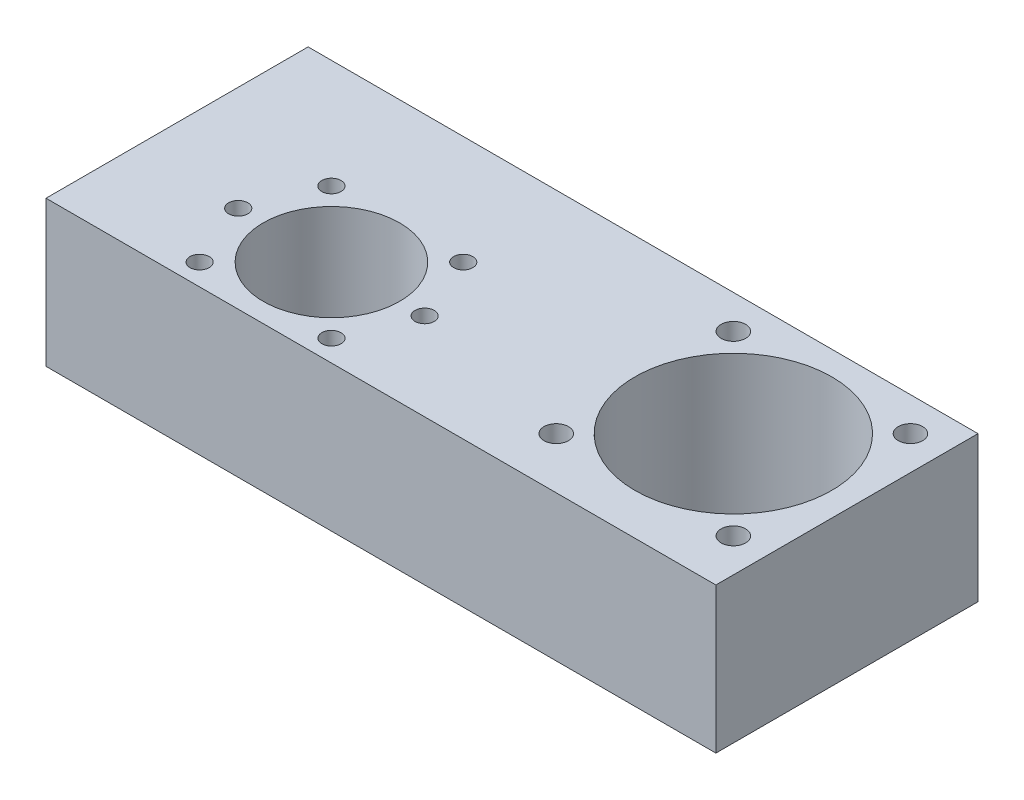
ISO-10303-21;
HEADER;
FILE_DESCRIPTION(('STEP AP214'),'2;1');
FILE_NAME('part.step','',(''),(''),'','','');
FILE_SCHEMA(('AUTOMOTIVE_DESIGN { 1 0 10303 214 1 1 1 1 }'));
ENDSEC;
DATA;
#1=APPLICATION_CONTEXT('core data for automotive mechanical design processes');
#2=APPLICATION_PROTOCOL_DEFINITION('international standard','automotive_design',2000,#1);
#3=PRODUCT_CONTEXT('',#1,'mechanical');
#4=PRODUCT('Part','Part','',(#3));
#5=PRODUCT_RELATED_PRODUCT_CATEGORY('part','',(#4));
#6=PRODUCT_DEFINITION_FORMATION('','',#4);
#7=PRODUCT_DEFINITION_CONTEXT('part definition',#1,'design');
#8=PRODUCT_DEFINITION('design','',#6,#7);
#9=PRODUCT_DEFINITION_SHAPE('','',#8);
#10=(LENGTH_UNIT() NAMED_UNIT(*) SI_UNIT(.MILLI.,.METRE.));
#11=(NAMED_UNIT(*) PLANE_ANGLE_UNIT() SI_UNIT($,.RADIAN.));
#12=(NAMED_UNIT(*) SI_UNIT($,.STERADIAN.) SOLID_ANGLE_UNIT());
#13=UNCERTAINTY_MEASURE_WITH_UNIT(LENGTH_MEASURE(1.E-05),#10,'distance_accuracy_value','');
#14=(GEOMETRIC_REPRESENTATION_CONTEXT(3) GLOBAL_UNCERTAINTY_ASSIGNED_CONTEXT((#13)) GLOBAL_UNIT_ASSIGNED_CONTEXT((#10,
#11,#12)) REPRESENTATION_CONTEXT('',''));
#15=CARTESIAN_POINT('',(0.,0.,0.));
#16=DIRECTION('',(0.,0.,1.));
#17=DIRECTION('',(1.,0.,0.));
#18=AXIS2_PLACEMENT_3D('',#15,#16,#17);
#19=CARTESIAN_POINT('',(0.,25.,0.));
#20=DIRECTION('',(-1.,0.,0.));
#21=DIRECTION('',(0.,0.,1.));
#22=AXIS2_PLACEMENT_3D('',#19,#20,#21);
#23=PLANE('',#22);
#24=DIRECTION('',(0.,0.,-1.));
#25=VECTOR('',#24,1.);
#26=CARTESIAN_POINT('',(0.,0.,0.));
#27=LINE('',#26,#25);
#28=CARTESIAN_POINT('',(0.,0.,0.));
#29=VERTEX_POINT('',#28);
#30=CARTESIAN_POINT('',(0.,0.,-45.));
#31=VERTEX_POINT('',#30);
#32=EDGE_CURVE('E100',#29,#31,#27,.T.);
#33=ORIENTED_EDGE('',*,*,#32,.T.);
#34=DIRECTION('',(0.,-1.,0.));
#35=VECTOR('',#34,1.);
#36=CARTESIAN_POINT('',(0.,25.,-45.));
#37=LINE('',#36,#35);
#38=CARTESIAN_POINT('',(0.,25.,-45.));
#39=VERTEX_POINT('',#38);
#40=EDGE_CURVE('E11',#39,#31,#37,.T.);
#41=ORIENTED_EDGE('',*,*,#40,.F.);
#42=DIRECTION('',(0.,0.,-1.));
#43=VECTOR('',#42,1.);
#44=CARTESIAN_POINT('',(0.,25.,0.));
#45=LINE('',#44,#43);
#46=CARTESIAN_POINT('',(0.,25.,0.));
#47=VERTEX_POINT('',#46);
#48=EDGE_CURVE('E88',#47,#39,#45,.T.);
#49=ORIENTED_EDGE('',*,*,#48,.F.);
#50=DIRECTION('',(0.,-1.,0.));
#51=VECTOR('',#50,1.);
#52=CARTESIAN_POINT('',(0.,25.,0.));
#53=LINE('',#52,#51);
#54=EDGE_CURVE('E96',#47,#29,#53,.T.);
#55=ORIENTED_EDGE('',*,*,#54,.T.);
#56=EDGE_LOOP('',(#33,#41,#49,#55));
#57=FACE_BOUND('',#56,.T.);
#58=ADVANCED_FACE('F37',(#57),#23,.F.);
#59=CARTESIAN_POINT('',(0.,25.,-45.));
#60=DIRECTION('',(0.,0.,1.));
#61=DIRECTION('',(1.,0.,0.));
#62=AXIS2_PLACEMENT_3D('',#59,#60,#61);
#63=PLANE('',#62);
#64=DIRECTION('',(-1.,0.,0.));
#65=VECTOR('',#64,1.);
#66=CARTESIAN_POINT('',(0.,0.,-45.));
#67=LINE('',#66,#65);
#68=CARTESIAN_POINT('',(-115.,0.,-45.));
#69=VERTEX_POINT('',#68);
#70=EDGE_CURVE('E92',#31,#69,#67,.T.);
#71=ORIENTED_EDGE('',*,*,#70,.T.);
#72=DIRECTION('',(0.,-1.,0.));
#73=VECTOR('',#72,1.);
#74=CARTESIAN_POINT('',(-115.,25.,-45.));
#75=LINE('',#74,#73);
#76=CARTESIAN_POINT('',(-115.,25.,-45.));
#77=VERTEX_POINT('',#76);
#78=EDGE_CURVE('E45',#77,#69,#75,.T.);
#79=ORIENTED_EDGE('',*,*,#78,.F.);
#80=DIRECTION('',(-1.,0.,0.));
#81=VECTOR('',#80,1.);
#82=CARTESIAN_POINT('',(0.,25.,-45.));
#83=LINE('',#82,#81);
#84=EDGE_CURVE('E83',#39,#77,#83,.T.);
#85=ORIENTED_EDGE('',*,*,#84,.F.);
#86=ORIENTED_EDGE('',*,*,#40,.T.);
#87=EDGE_LOOP('',(#71,#79,#85,#86));
#88=FACE_BOUND('',#87,.T.);
#89=ADVANCED_FACE('F91',(#88),#63,.F.);
#90=CARTESIAN_POINT('',(-115.,25.,0.));
#91=DIRECTION('',(1.,0.,0.));
#92=DIRECTION('',(0.,0.,-1.));
#93=AXIS2_PLACEMENT_3D('',#90,#91,#92);
#94=PLANE('',#93);
#95=DIRECTION('',(0.,0.,1.));
#96=VECTOR('',#95,1.);
#97=CARTESIAN_POINT('',(-115.,0.,0.));
#98=LINE('',#97,#96);
#99=CARTESIAN_POINT('',(-115.,0.,0.));
#100=VERTEX_POINT('',#99);
#101=EDGE_CURVE('E70',#69,#100,#98,.T.);
#102=ORIENTED_EDGE('',*,*,#101,.T.);
#103=DIRECTION('',(0.,-1.,0.));
#104=VECTOR('',#103,1.);
#105=CARTESIAN_POINT('',(-115.,25.,0.));
#106=LINE('',#105,#104);
#107=CARTESIAN_POINT('',(-115.,25.,0.));
#108=VERTEX_POINT('',#107);
#109=EDGE_CURVE('E93',#108,#100,#106,.T.);
#110=ORIENTED_EDGE('',*,*,#109,.F.);
#111=DIRECTION('',(0.,0.,1.));
#112=VECTOR('',#111,1.);
#113=CARTESIAN_POINT('',(-115.,25.,0.));
#114=LINE('',#113,#112);
#115=EDGE_CURVE('E86',#77,#108,#114,.T.);
#116=ORIENTED_EDGE('',*,*,#115,.F.);
#117=ORIENTED_EDGE('',*,*,#78,.T.);
#118=EDGE_LOOP('',(#102,#110,#116,#117));
#119=FACE_BOUND('',#118,.T.);
#120=ADVANCED_FACE('F94',(#119),#94,.F.);
#121=CARTESIAN_POINT('',(0.,25.,0.));
#122=DIRECTION('',(0.,0.,-1.));
#123=DIRECTION('',(-1.,0.,0.));
#124=AXIS2_PLACEMENT_3D('',#121,#122,#123);
#125=PLANE('',#124);
#126=DIRECTION('',(1.,0.,0.));
#127=VECTOR('',#126,1.);
#128=CARTESIAN_POINT('',(0.,0.,0.));
#129=LINE('',#128,#127);
#130=EDGE_CURVE('E76',#100,#29,#129,.T.);
#131=ORIENTED_EDGE('',*,*,#130,.T.);
#132=ORIENTED_EDGE('',*,*,#54,.F.);
#133=DIRECTION('',(1.,0.,0.));
#134=VECTOR('',#133,1.);
#135=CARTESIAN_POINT('',(0.,25.,0.));
#136=LINE('',#135,#134);
#137=EDGE_CURVE('E53',#108,#47,#136,.T.);
#138=ORIENTED_EDGE('',*,*,#137,.F.);
#139=ORIENTED_EDGE('',*,*,#109,.T.);
#140=EDGE_LOOP('',(#131,#132,#138,#139));
#141=FACE_BOUND('',#140,.T.);
#142=ADVANCED_FACE('F108',(#141),#125,.F.);
#143=CARTESIAN_POINT('',(0.,25.,0.));
#144=DIRECTION('',(0.,1.,0.));
#145=DIRECTION('',(0.,0.,1.));
#146=AXIS2_PLACEMENT_3D('',#143,#144,#145);
#147=PLANE('',#146);
#148=CARTESIAN_POINT('',(-92.3137084989844,25.,-3.68629150101509));
#149=DIRECTION('',(0.,-1.,0.));
#150=DIRECTION('',(0.,0.,-1.));
#151=AXIS2_PLACEMENT_3D('',#148,#149,#150);
#152=CIRCLE('',#151,1.64999999999998);
#153=CARTESIAN_POINT('',(-92.3137084989844,25.,-5.33629150101508));
#154=VERTEX_POINT('',#153);
#155=EDGE_CURVE('E179',#154,#154,#152,.T.);
#156=ORIENTED_EDGE('',*,*,#155,.T.);
#157=EDGE_LOOP('',(#156));
#158=FACE_BOUND('',#157,.T.);
#159=CARTESIAN_POINT('',(-96.9999999999996,25.,-14.9999999999999));
#160=DIRECTION('',(0.,-1.,0.));
#161=DIRECTION('',(0.,0.,-1.));
#162=AXIS2_PLACEMENT_3D('',#159,#160,#161);
#163=CIRCLE('',#162,1.64999999999998);
#164=CARTESIAN_POINT('',(-96.9999999999996,25.,-16.6499999999999));
#165=VERTEX_POINT('',#164);
#166=EDGE_CURVE('E173',#165,#165,#163,.T.);
#167=ORIENTED_EDGE('',*,*,#166,.T.);
#168=EDGE_LOOP('',(#167));
#169=FACE_BOUND('',#168,.T.);
#170=CARTESIAN_POINT('',(-92.3137084989844,25.,-26.3137084989847));
#171=DIRECTION('',(0.,-1.,0.));
#172=DIRECTION('',(0.,0.,-1.));
#173=AXIS2_PLACEMENT_3D('',#170,#171,#172);
#174=CIRCLE('',#173,1.64999999999998);
#175=CARTESIAN_POINT('',(-92.3137084989844,25.,-27.9637084989847));
#176=VERTEX_POINT('',#175);
#177=EDGE_CURVE('E167',#176,#176,#174,.T.);
#178=ORIENTED_EDGE('',*,*,#177,.T.);
#179=EDGE_LOOP('',(#178));
#180=FACE_BOUND('',#179,.T.);
#181=CARTESIAN_POINT('',(-69.6862915010148,25.,-26.3137084989847));
#182=DIRECTION('',(0.,-1.,0.));
#183=DIRECTION('',(0.,0.,-1.));
#184=AXIS2_PLACEMENT_3D('',#181,#182,#183);
#185=CIRCLE('',#184,1.64999999999998);
#186=CARTESIAN_POINT('',(-69.6862915010148,25.,-27.9637084989847));
#187=VERTEX_POINT('',#186);
#188=EDGE_CURVE('E161',#187,#187,#185,.T.);
#189=ORIENTED_EDGE('',*,*,#188,.T.);
#190=EDGE_LOOP('',(#189));
#191=FACE_BOUND('',#190,.T.);
#192=CARTESIAN_POINT('',(-64.9999999999996,25.,-14.9999999999999));
#193=DIRECTION('',(0.,-1.,0.));
#194=DIRECTION('',(0.,0.,-1.));
#195=AXIS2_PLACEMENT_3D('',#192,#193,#194);
#196=CIRCLE('',#195,1.64999999999998);
#197=CARTESIAN_POINT('',(-64.9999999999996,25.,-16.6499999999999));
#198=VERTEX_POINT('',#197);
#199=EDGE_CURVE('E155',#198,#198,#196,.T.);
#200=ORIENTED_EDGE('',*,*,#199,.T.);
#201=EDGE_LOOP('',(#200));
#202=FACE_BOUND('',#201,.T.);
#203=CARTESIAN_POINT('',(-69.6862915010148,25.,-3.6862915010151));
#204=DIRECTION('',(0.,-1.,0.));
#205=DIRECTION('',(0.,0.,-1.));
#206=AXIS2_PLACEMENT_3D('',#203,#204,#205);
#207=CIRCLE('',#206,1.64999999999998);
#208=CARTESIAN_POINT('',(-69.6862915010148,25.,-5.33629150101508));
#209=VERTEX_POINT('',#208);
#210=EDGE_CURVE('E149',#209,#209,#207,.T.);
#211=ORIENTED_EDGE('',*,*,#210,.T.);
#212=EDGE_LOOP('',(#211));
#213=FACE_BOUND('',#212,.T.);
#214=CARTESIAN_POINT('',(-36.2027957955106,25.,-39.2027957955107));
#215=DIRECTION('',(0.,-1.,0.));
#216=DIRECTION('',(0.,0.,-1.));
#217=AXIS2_PLACEMENT_3D('',#214,#215,#216);
#218=CIRCLE('',#217,2.09999999999999);
#219=CARTESIAN_POINT('',(-36.2027957955106,25.,-41.3027957955107));
#220=VERTEX_POINT('',#219);
#221=EDGE_CURVE('E143',#220,#220,#218,.T.);
#222=ORIENTED_EDGE('',*,*,#221,.T.);
#223=EDGE_LOOP('',(#222));
#224=FACE_BOUND('',#223,.T.);
#225=CARTESIAN_POINT('',(-5.79720420448917,25.,-39.2027957955106));
#226=DIRECTION('',(0.,-1.,0.));
#227=DIRECTION('',(0.,0.,-1.));
#228=AXIS2_PLACEMENT_3D('',#225,#226,#227);
#229=CIRCLE('',#228,2.09999999999999);
#230=CARTESIAN_POINT('',(-5.79720420448917,25.,-41.3027957955106));
#231=VERTEX_POINT('',#230);
#232=EDGE_CURVE('E137',#231,#231,#229,.T.);
#233=ORIENTED_EDGE('',*,*,#232,.T.);
#234=EDGE_LOOP('',(#233));
#235=FACE_BOUND('',#234,.T.);
#236=CARTESIAN_POINT('',(-5.79720420448923,25.,-8.79720420448897));
#237=DIRECTION('',(0.,-1.,0.));
#238=DIRECTION('',(0.,0.,-1.));
#239=AXIS2_PLACEMENT_3D('',#236,#237,#238);
#240=CIRCLE('',#239,2.09999999999999);
#241=CARTESIAN_POINT('',(-5.79720420448923,25.,-10.897204204489));
#242=VERTEX_POINT('',#241);
#243=EDGE_CURVE('E131',#242,#242,#240,.T.);
#244=ORIENTED_EDGE('',*,*,#243,.T.);
#245=EDGE_LOOP('',(#244));
#246=FACE_BOUND('',#245,.T.);
#247=CARTESIAN_POINT('',(-36.2027957955107,25.,-8.79720420448903));
#248=DIRECTION('',(0.,-1.,0.));
#249=DIRECTION('',(0.,0.,-1.));
#250=AXIS2_PLACEMENT_3D('',#247,#248,#249);
#251=CIRCLE('',#250,2.09999999999999);
#252=CARTESIAN_POINT('',(-36.2027957955107,25.,-10.897204204489));
#253=VERTEX_POINT('',#252);
#254=EDGE_CURVE('E118',#253,#253,#251,.T.);
#255=ORIENTED_EDGE('',*,*,#254,.T.);
#256=EDGE_LOOP('',(#255));
#257=FACE_BOUND('',#256,.T.);
#258=CARTESIAN_POINT('',(-80.9999999999996,25.,-14.9999999999999));
#259=DIRECTION('',(0.,-1.,0.));
#260=DIRECTION('',(0.,0.,-1.));
#261=AXIS2_PLACEMENT_3D('',#258,#259,#260);
#262=CIRCLE('',#261,11.7);
#263=CARTESIAN_POINT('',(-80.9999999999996,25.,-26.6999999999999));
#264=VERTEX_POINT('',#263);
#265=EDGE_CURVE('E103',#264,#264,#262,.T.);
#266=ORIENTED_EDGE('',*,*,#265,.T.);
#267=EDGE_LOOP('',(#266));
#268=FACE_BOUND('',#267,.T.);
#269=CARTESIAN_POINT('',(-20.9999999999999,25.,-23.9999999999998));
#270=DIRECTION('',(0.,-1.,0.));
#271=DIRECTION('',(0.,0.,-1.));
#272=AXIS2_PLACEMENT_3D('',#269,#270,#271);
#273=CIRCLE('',#272,16.9);
#274=CARTESIAN_POINT('',(-20.9999999999999,25.,-40.8999999999998));
#275=VERTEX_POINT('',#274);
#276=EDGE_CURVE('E117',#275,#275,#273,.T.);
#277=ORIENTED_EDGE('',*,*,#276,.T.);
#278=EDGE_LOOP('',(#277));
#279=FACE_BOUND('',#278,.T.);
#280=ORIENTED_EDGE('',*,*,#48,.T.);
#281=ORIENTED_EDGE('',*,*,#84,.T.);
#282=ORIENTED_EDGE('',*,*,#115,.T.);
#283=ORIENTED_EDGE('',*,*,#137,.T.);
#284=EDGE_LOOP('',(#280,#281,#282,#283));
#285=FACE_BOUND('',#284,.T.);
#286=ADVANCED_FACE('F84',(#158,#169,#180,#191,#202,#213,#224,#235,#246,#257,#268,#279,#285),
#147,.T.);
#287=CARTESIAN_POINT('',(0.,0.,0.));
#288=DIRECTION('',(0.,1.,0.));
#289=DIRECTION('',(0.,0.,1.));
#290=AXIS2_PLACEMENT_3D('',#287,#288,#289);
#291=PLANE('',#290);
#292=CARTESIAN_POINT('',(-92.3137084989844,0.,-3.68629150101509));
#293=DIRECTION('',(0.,-1.,0.));
#294=DIRECTION('',(0.,0.,-1.));
#295=AXIS2_PLACEMENT_3D('',#292,#293,#294);
#296=CIRCLE('',#295,1.65);
#297=CARTESIAN_POINT('',(-92.3137084989844,0.,-5.33629150101509));
#298=VERTEX_POINT('',#297);
#299=EDGE_CURVE('E182',#298,#298,#296,.T.);
#300=ORIENTED_EDGE('',*,*,#299,.F.);
#301=EDGE_LOOP('',(#300));
#302=FACE_BOUND('',#301,.T.);
#303=CARTESIAN_POINT('',(-96.9999999999996,0.,-14.9999999999999));
#304=DIRECTION('',(0.,-1.,0.));
#305=DIRECTION('',(0.,0.,-1.));
#306=AXIS2_PLACEMENT_3D('',#303,#304,#305);
#307=CIRCLE('',#306,1.65);
#308=CARTESIAN_POINT('',(-96.9999999999996,0.,-16.6499999999999));
#309=VERTEX_POINT('',#308);
#310=EDGE_CURVE('E176',#309,#309,#307,.T.);
#311=ORIENTED_EDGE('',*,*,#310,.F.);
#312=EDGE_LOOP('',(#311));
#313=FACE_BOUND('',#312,.T.);
#314=CARTESIAN_POINT('',(-92.3137084989844,0.,-26.3137084989847));
#315=DIRECTION('',(0.,-1.,0.));
#316=DIRECTION('',(0.,0.,-1.));
#317=AXIS2_PLACEMENT_3D('',#314,#315,#316);
#318=CIRCLE('',#317,1.65);
#319=CARTESIAN_POINT('',(-92.3137084989844,0.,-27.9637084989847));
#320=VERTEX_POINT('',#319);
#321=EDGE_CURVE('E170',#320,#320,#318,.T.);
#322=ORIENTED_EDGE('',*,*,#321,.F.);
#323=EDGE_LOOP('',(#322));
#324=FACE_BOUND('',#323,.T.);
#325=CARTESIAN_POINT('',(-69.6862915010148,0.,-26.3137084989847));
#326=DIRECTION('',(0.,-1.,0.));
#327=DIRECTION('',(0.,0.,-1.));
#328=AXIS2_PLACEMENT_3D('',#325,#326,#327);
#329=CIRCLE('',#328,1.65);
#330=CARTESIAN_POINT('',(-69.6862915010148,0.,-27.9637084989847));
#331=VERTEX_POINT('',#330);
#332=EDGE_CURVE('E164',#331,#331,#329,.T.);
#333=ORIENTED_EDGE('',*,*,#332,.F.);
#334=EDGE_LOOP('',(#333));
#335=FACE_BOUND('',#334,.T.);
#336=CARTESIAN_POINT('',(-64.9999999999996,0.,-14.9999999999999));
#337=DIRECTION('',(0.,-1.,0.));
#338=DIRECTION('',(0.,0.,-1.));
#339=AXIS2_PLACEMENT_3D('',#336,#337,#338);
#340=CIRCLE('',#339,1.65);
#341=CARTESIAN_POINT('',(-64.9999999999996,0.,-16.6499999999999));
#342=VERTEX_POINT('',#341);
#343=EDGE_CURVE('E158',#342,#342,#340,.T.);
#344=ORIENTED_EDGE('',*,*,#343,.F.);
#345=EDGE_LOOP('',(#344));
#346=FACE_BOUND('',#345,.T.);
#347=CARTESIAN_POINT('',(-69.6862915010148,0.,-3.6862915010151));
#348=DIRECTION('',(0.,-1.,0.));
#349=DIRECTION('',(0.,0.,-1.));
#350=AXIS2_PLACEMENT_3D('',#347,#348,#349);
#351=CIRCLE('',#350,1.65);
#352=CARTESIAN_POINT('',(-69.6862915010148,0.,-5.3362915010151));
#353=VERTEX_POINT('',#352);
#354=EDGE_CURVE('E152',#353,#353,#351,.T.);
#355=ORIENTED_EDGE('',*,*,#354,.F.);
#356=EDGE_LOOP('',(#355));
#357=FACE_BOUND('',#356,.T.);
#358=CARTESIAN_POINT('',(-36.2027957955106,0.,-39.2027957955107));
#359=DIRECTION('',(0.,-1.,0.));
#360=DIRECTION('',(0.,0.,-1.));
#361=AXIS2_PLACEMENT_3D('',#358,#359,#360);
#362=CIRCLE('',#361,2.1);
#363=CARTESIAN_POINT('',(-36.2027957955106,0.,-41.3027957955107));
#364=VERTEX_POINT('',#363);
#365=EDGE_CURVE('E146',#364,#364,#362,.T.);
#366=ORIENTED_EDGE('',*,*,#365,.F.);
#367=EDGE_LOOP('',(#366));
#368=FACE_BOUND('',#367,.T.);
#369=CARTESIAN_POINT('',(-5.79720420448917,0.,-39.2027957955106));
#370=DIRECTION('',(0.,-1.,0.));
#371=DIRECTION('',(0.,0.,-1.));
#372=AXIS2_PLACEMENT_3D('',#369,#370,#371);
#373=CIRCLE('',#372,2.1);
#374=CARTESIAN_POINT('',(-5.79720420448917,0.,-41.3027957955106));
#375=VERTEX_POINT('',#374);
#376=EDGE_CURVE('E140',#375,#375,#373,.T.);
#377=ORIENTED_EDGE('',*,*,#376,.F.);
#378=EDGE_LOOP('',(#377));
#379=FACE_BOUND('',#378,.T.);
#380=CARTESIAN_POINT('',(-5.79720420448923,0.,-8.79720420448897));
#381=DIRECTION('',(0.,-1.,0.));
#382=DIRECTION('',(0.,0.,-1.));
#383=AXIS2_PLACEMENT_3D('',#380,#381,#382);
#384=CIRCLE('',#383,2.1);
#385=CARTESIAN_POINT('',(-5.79720420448923,0.,-10.897204204489));
#386=VERTEX_POINT('',#385);
#387=EDGE_CURVE('E134',#386,#386,#384,.T.);
#388=ORIENTED_EDGE('',*,*,#387,.F.);
#389=EDGE_LOOP('',(#388));
#390=FACE_BOUND('',#389,.T.);
#391=CARTESIAN_POINT('',(-36.2027957955107,0.,-8.79720420448903));
#392=DIRECTION('',(0.,-1.,0.));
#393=DIRECTION('',(0.,0.,-1.));
#394=AXIS2_PLACEMENT_3D('',#391,#392,#393);
#395=CIRCLE('',#394,2.1);
#396=CARTESIAN_POINT('',(-36.2027957955107,0.,-10.897204204489));
#397=VERTEX_POINT('',#396);
#398=EDGE_CURVE('E128',#397,#397,#395,.T.);
#399=ORIENTED_EDGE('',*,*,#398,.F.);
#400=EDGE_LOOP('',(#399));
#401=FACE_BOUND('',#400,.T.);
#402=CARTESIAN_POINT('',(-80.9999999999996,0.,-14.9999999999999));
#403=DIRECTION('',(0.,-1.,0.));
#404=DIRECTION('',(0.,0.,-1.));
#405=AXIS2_PLACEMENT_3D('',#402,#403,#404);
#406=CIRCLE('',#405,11.7);
#407=CARTESIAN_POINT('',(-80.9999999999996,0.,-26.6999999999999));
#408=VERTEX_POINT('',#407);
#409=EDGE_CURVE('E121',#408,#408,#406,.T.);
#410=ORIENTED_EDGE('',*,*,#409,.F.);
#411=EDGE_LOOP('',(#410));
#412=FACE_BOUND('',#411,.T.);
#413=CARTESIAN_POINT('',(-20.9999999999999,0.,-23.9999999999998));
#414=DIRECTION('',(0.,-1.,0.));
#415=DIRECTION('',(0.,0.,-1.));
#416=AXIS2_PLACEMENT_3D('',#413,#414,#415);
#417=CIRCLE('',#416,16.9);
#418=CARTESIAN_POINT('',(-20.9999999999999,0.,-40.8999999999998));
#419=VERTEX_POINT('',#418);
#420=EDGE_CURVE('E114',#419,#419,#417,.T.);
#421=ORIENTED_EDGE('',*,*,#420,.F.);
#422=EDGE_LOOP('',(#421));
#423=FACE_BOUND('',#422,.T.);
#424=ORIENTED_EDGE('',*,*,#32,.F.);
#425=ORIENTED_EDGE('',*,*,#130,.F.);
#426=ORIENTED_EDGE('',*,*,#101,.F.);
#427=ORIENTED_EDGE('',*,*,#70,.F.);
#428=EDGE_LOOP('',(#424,#425,#426,#427));
#429=FACE_BOUND('',#428,.T.);
#430=ADVANCED_FACE('F111',(#302,#313,#324,#335,#346,#357,#368,#379,#390,#401,#412,#423,#429),
#291,.F.);
#431=CARTESIAN_POINT('',(-20.9999999999999,25.,-23.9999999999998));
#432=DIRECTION('',(0.,-1.,0.));
#433=DIRECTION('',(0.,0.,-1.));
#434=AXIS2_PLACEMENT_3D('',#431,#432,#433);
#435=CYLINDRICAL_SURFACE('',#434,16.9);
#436=ORIENTED_EDGE('',*,*,#276,.F.);
#437=EDGE_LOOP('',(#436));
#438=FACE_BOUND('',#437,.T.);
#439=ORIENTED_EDGE('',*,*,#420,.T.);
#440=EDGE_LOOP('',(#439));
#441=FACE_BOUND('',#440,.T.);
#442=ADVANCED_FACE('F190',(#438,#441),#435,.F.);
#443=CARTESIAN_POINT('',(-80.9999999999996,25.,-14.9999999999999));
#444=DIRECTION('',(0.,-1.,0.));
#445=DIRECTION('',(0.,0.,-1.));
#446=AXIS2_PLACEMENT_3D('',#443,#444,#445);
#447=CYLINDRICAL_SURFACE('',#446,11.7);
#448=ORIENTED_EDGE('',*,*,#265,.F.);
#449=EDGE_LOOP('',(#448));
#450=FACE_BOUND('',#449,.T.);
#451=ORIENTED_EDGE('',*,*,#409,.T.);
#452=EDGE_LOOP('',(#451));
#453=FACE_BOUND('',#452,.T.);
#454=ADVANCED_FACE('F215',(#450,#453),#447,.F.);
#455=CARTESIAN_POINT('',(-36.2027957955107,0.,-8.79720420448903));
#456=DIRECTION('',(0.,-1.,0.));
#457=DIRECTION('',(0.,0.,-1.));
#458=AXIS2_PLACEMENT_3D('',#455,#456,#457);
#459=CYLINDRICAL_SURFACE('',#458,2.09999999999999);
#460=ORIENTED_EDGE('',*,*,#254,.F.);
#461=EDGE_LOOP('',(#460));
#462=FACE_BOUND('',#461,.T.);
#463=ORIENTED_EDGE('',*,*,#398,.T.);
#464=EDGE_LOOP('',(#463));
#465=FACE_BOUND('',#464,.T.);
#466=ADVANCED_FACE('F221',(#462,#465),#459,.F.);
#467=CARTESIAN_POINT('',(-5.79720420448923,0.,-8.79720420448897));
#468=DIRECTION('',(0.,-1.,0.));
#469=DIRECTION('',(0.,0.,-1.));
#470=AXIS2_PLACEMENT_3D('',#467,#468,#469);
#471=CYLINDRICAL_SURFACE('',#470,2.1);
#472=ORIENTED_EDGE('',*,*,#243,.F.);
#473=EDGE_LOOP('',(#472));
#474=FACE_BOUND('',#473,.T.);
#475=ORIENTED_EDGE('',*,*,#387,.T.);
#476=EDGE_LOOP('',(#475));
#477=FACE_BOUND('',#476,.T.);
#478=ADVANCED_FACE('F266',(#474,#477),#471,.F.);
#479=CARTESIAN_POINT('',(-5.79720420448917,0.,-39.2027957955106));
#480=DIRECTION('',(0.,-1.,0.));
#481=DIRECTION('',(0.,0.,-1.));
#482=AXIS2_PLACEMENT_3D('',#479,#480,#481);
#483=CYLINDRICAL_SURFACE('',#482,2.1);
#484=ORIENTED_EDGE('',*,*,#232,.F.);
#485=EDGE_LOOP('',(#484));
#486=FACE_BOUND('',#485,.T.);
#487=ORIENTED_EDGE('',*,*,#376,.T.);
#488=EDGE_LOOP('',(#487));
#489=FACE_BOUND('',#488,.T.);
#490=ADVANCED_FACE('F271',(#486,#489),#483,.F.);
#491=CARTESIAN_POINT('',(-36.2027957955106,0.,-39.2027957955107));
#492=DIRECTION('',(0.,-1.,0.));
#493=DIRECTION('',(0.,0.,-1.));
#494=AXIS2_PLACEMENT_3D('',#491,#492,#493);
#495=CYLINDRICAL_SURFACE('',#494,2.09999999999999);
#496=ORIENTED_EDGE('',*,*,#221,.F.);
#497=EDGE_LOOP('',(#496));
#498=FACE_BOUND('',#497,.T.);
#499=ORIENTED_EDGE('',*,*,#365,.T.);
#500=EDGE_LOOP('',(#499));
#501=FACE_BOUND('',#500,.T.);
#502=ADVANCED_FACE('F277',(#498,#501),#495,.F.);
#503=CARTESIAN_POINT('',(-69.6862915010148,0.,-3.6862915010151));
#504=DIRECTION('',(0.,-1.,0.));
#505=DIRECTION('',(0.,0.,-1.));
#506=AXIS2_PLACEMENT_3D('',#503,#504,#505);
#507=CYLINDRICAL_SURFACE('',#506,1.64999999999999);
#508=ORIENTED_EDGE('',*,*,#210,.F.);
#509=EDGE_LOOP('',(#508));
#510=FACE_BOUND('',#509,.T.);
#511=ORIENTED_EDGE('',*,*,#354,.T.);
#512=EDGE_LOOP('',(#511));
#513=FACE_BOUND('',#512,.T.);
#514=ADVANCED_FACE('F281',(#510,#513),#507,.F.);
#515=CARTESIAN_POINT('',(-64.9999999999996,0.,-14.9999999999999));
#516=DIRECTION('',(0.,-1.,0.));
#517=DIRECTION('',(0.,0.,-1.));
#518=AXIS2_PLACEMENT_3D('',#515,#516,#517);
#519=CYLINDRICAL_SURFACE('',#518,1.64999999999999);
#520=ORIENTED_EDGE('',*,*,#199,.F.);
#521=EDGE_LOOP('',(#520));
#522=FACE_BOUND('',#521,.T.);
#523=ORIENTED_EDGE('',*,*,#343,.T.);
#524=EDGE_LOOP('',(#523));
#525=FACE_BOUND('',#524,.T.);
#526=ADVANCED_FACE('F285',(#522,#525),#519,.F.);
#527=CARTESIAN_POINT('',(-69.6862915010148,0.,-26.3137084989847));
#528=DIRECTION('',(0.,-1.,0.));
#529=DIRECTION('',(0.,0.,-1.));
#530=AXIS2_PLACEMENT_3D('',#527,#528,#529);
#531=CYLINDRICAL_SURFACE('',#530,1.64999999999999);
#532=ORIENTED_EDGE('',*,*,#188,.F.);
#533=EDGE_LOOP('',(#532));
#534=FACE_BOUND('',#533,.T.);
#535=ORIENTED_EDGE('',*,*,#332,.T.);
#536=EDGE_LOOP('',(#535));
#537=FACE_BOUND('',#536,.T.);
#538=ADVANCED_FACE('F289',(#534,#537),#531,.F.);
#539=CARTESIAN_POINT('',(-92.3137084989844,0.,-26.3137084989847));
#540=DIRECTION('',(0.,-1.,0.));
#541=DIRECTION('',(0.,0.,-1.));
#542=AXIS2_PLACEMENT_3D('',#539,#540,#541);
#543=CYLINDRICAL_SURFACE('',#542,1.64999999999999);
#544=ORIENTED_EDGE('',*,*,#177,.F.);
#545=EDGE_LOOP('',(#544));
#546=FACE_BOUND('',#545,.T.);
#547=ORIENTED_EDGE('',*,*,#321,.T.);
#548=EDGE_LOOP('',(#547));
#549=FACE_BOUND('',#548,.T.);
#550=ADVANCED_FACE('F293',(#546,#549),#543,.F.);
#551=CARTESIAN_POINT('',(-96.9999999999996,0.,-14.9999999999999));
#552=DIRECTION('',(0.,-1.,0.));
#553=DIRECTION('',(0.,0.,-1.));
#554=AXIS2_PLACEMENT_3D('',#551,#552,#553);
#555=CYLINDRICAL_SURFACE('',#554,1.64999999999999);
#556=ORIENTED_EDGE('',*,*,#166,.F.);
#557=EDGE_LOOP('',(#556));
#558=FACE_BOUND('',#557,.T.);
#559=ORIENTED_EDGE('',*,*,#310,.T.);
#560=EDGE_LOOP('',(#559));
#561=FACE_BOUND('',#560,.T.);
#562=ADVANCED_FACE('F297',(#558,#561),#555,.F.);
#563=CARTESIAN_POINT('',(-92.3137084989844,0.,-3.68629150101509));
#564=DIRECTION('',(0.,-1.,0.));
#565=DIRECTION('',(0.,0.,-1.));
#566=AXIS2_PLACEMENT_3D('',#563,#564,#565);
#567=CYLINDRICAL_SURFACE('',#566,1.64999999999999);
#568=ORIENTED_EDGE('',*,*,#155,.F.);
#569=EDGE_LOOP('',(#568));
#570=FACE_BOUND('',#569,.T.);
#571=ORIENTED_EDGE('',*,*,#299,.T.);
#572=EDGE_LOOP('',(#571));
#573=FACE_BOUND('',#572,.T.);
#574=ADVANCED_FACE('F186',(#570,#573),#567,.F.);
#575=CLOSED_SHELL('',(#58,#89,#120,#142,#286,#430,#442,#454,#466,#478,#490,#502,#514,#526,#538,
#550,#562,#574));
#576=MANIFOLD_SOLID_BREP('B2',#575);
#577=ADVANCED_BREP_SHAPE_REPRESENTATION('',(#18,#576),#14);
#578=SHAPE_DEFINITION_REPRESENTATION(#9,#577);
ENDSEC;
END-ISO-10303-21;
